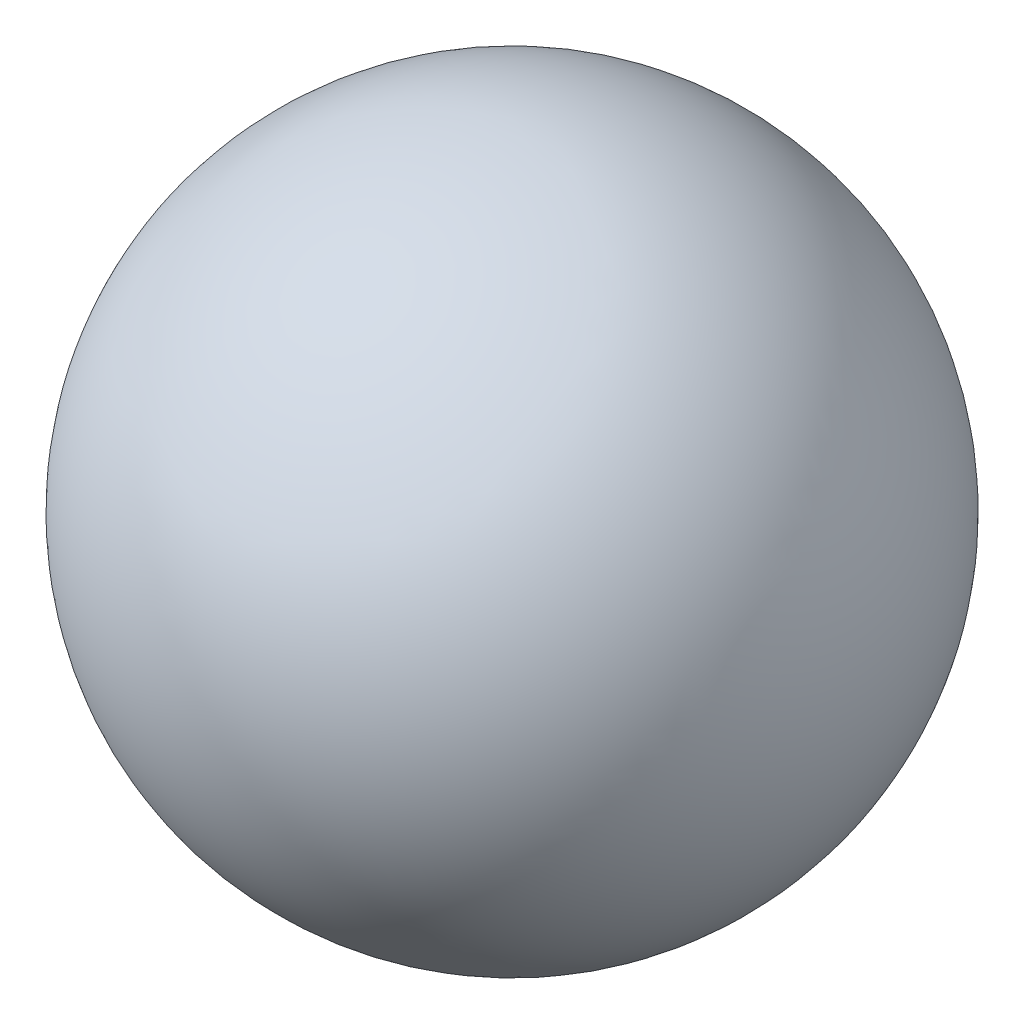
ISO-10303-21;
HEADER;
FILE_DESCRIPTION(('STEP AP214'),'2;1');
FILE_NAME('part.step','',(''),(''),'','','');
FILE_SCHEMA(('AUTOMOTIVE_DESIGN { 1 0 10303 214 1 1 1 1 }'));
ENDSEC;
DATA;
#1=APPLICATION_CONTEXT('core data for automotive mechanical design processes');
#2=APPLICATION_PROTOCOL_DEFINITION('international standard','automotive_design',2000,#1);
#3=PRODUCT_CONTEXT('',#1,'mechanical');
#4=PRODUCT('Part','Part','',(#3));
#5=PRODUCT_RELATED_PRODUCT_CATEGORY('part','',(#4));
#6=PRODUCT_DEFINITION_FORMATION('','',#4);
#7=PRODUCT_DEFINITION_CONTEXT('part definition',#1,'design');
#8=PRODUCT_DEFINITION('design','',#6,#7);
#9=PRODUCT_DEFINITION_SHAPE('','',#8);
#10=(LENGTH_UNIT() NAMED_UNIT(*) SI_UNIT(.MILLI.,.METRE.));
#11=(NAMED_UNIT(*) PLANE_ANGLE_UNIT() SI_UNIT($,.RADIAN.));
#12=(NAMED_UNIT(*) SI_UNIT($,.STERADIAN.) SOLID_ANGLE_UNIT());
#13=UNCERTAINTY_MEASURE_WITH_UNIT(LENGTH_MEASURE(1.E-05),#10,'distance_accuracy_value','');
#14=(GEOMETRIC_REPRESENTATION_CONTEXT(3) GLOBAL_UNCERTAINTY_ASSIGNED_CONTEXT((#13)) GLOBAL_UNIT_ASSIGNED_CONTEXT((#10,
#11,#12)) REPRESENTATION_CONTEXT('',''));
#15=CARTESIAN_POINT('',(0.,0.,0.));
#16=DIRECTION('',(0.,0.,1.));
#17=DIRECTION('',(1.,0.,0.));
#18=AXIS2_PLACEMENT_3D('',#15,#16,#17);
#19=CARTESIAN_POINT('',(2.5,9.75,0.));
#20=DIRECTION('',(1.,0.,0.));
#21=DIRECTION('',(0.,-1.,0.));
#22=AXIS2_PLACEMENT_3D('',#19,#20,#21);
#23=SPHERICAL_SURFACE('',#22,1.1905);
#24=CARTESIAN_POINT('',(3.6905,9.75,0.));
#25=VERTEX_POINT('',#24);
#26=VERTEX_LOOP('',#25);
#27=FACE_BOUND('',#26,.T.);
#28=ADVANCED_FACE('F34',(#27),#23,.T.);
#29=CLOSED_SHELL('',(#28));
#30=MANIFOLD_SOLID_BREP('B2',#29);
#31=ADVANCED_BREP_SHAPE_REPRESENTATION('',(#18,#30),#14);
#32=SHAPE_DEFINITION_REPRESENTATION(#9,#31);
ENDSEC;
END-ISO-10303-21;
